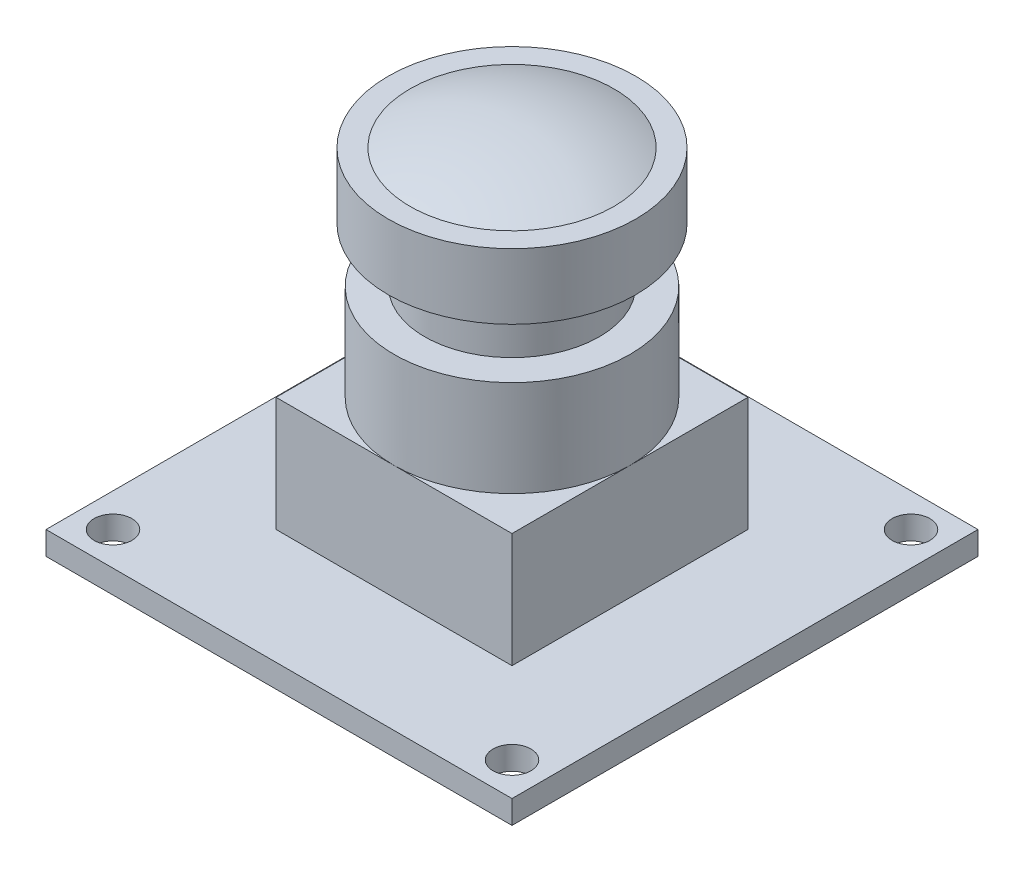
ISO-10303-21;
HEADER;
FILE_DESCRIPTION(('STEP AP214'),'2;1');
FILE_NAME('part.step','',(''),(''),'','','');
FILE_SCHEMA(('AUTOMOTIVE_DESIGN { 1 0 10303 214 1 1 1 1 }'));
ENDSEC;
DATA;
#1=APPLICATION_CONTEXT('core data for automotive mechanical design processes');
#2=APPLICATION_PROTOCOL_DEFINITION('international standard','automotive_design',2000,#1);
#3=PRODUCT_CONTEXT('',#1,'mechanical');
#4=PRODUCT('Part','Part','',(#3));
#5=PRODUCT_RELATED_PRODUCT_CATEGORY('part','',(#4));
#6=PRODUCT_DEFINITION_FORMATION('','',#4);
#7=PRODUCT_DEFINITION_CONTEXT('part definition',#1,'design');
#8=PRODUCT_DEFINITION('design','',#6,#7);
#9=PRODUCT_DEFINITION_SHAPE('','',#8);
#10=(LENGTH_UNIT() NAMED_UNIT(*) SI_UNIT(.MILLI.,.METRE.));
#11=(NAMED_UNIT(*) PLANE_ANGLE_UNIT() SI_UNIT($,.RADIAN.));
#12=(NAMED_UNIT(*) SI_UNIT($,.STERADIAN.) SOLID_ANGLE_UNIT());
#13=UNCERTAINTY_MEASURE_WITH_UNIT(LENGTH_MEASURE(1.E-05),#10,'distance_accuracy_value','');
#14=(GEOMETRIC_REPRESENTATION_CONTEXT(3) GLOBAL_UNCERTAINTY_ASSIGNED_CONTEXT((#13)) GLOBAL_UNIT_ASSIGNED_CONTEXT((#10,
#11,#12)) REPRESENTATION_CONTEXT('',''));
#15=CARTESIAN_POINT('',(0.,0.,0.));
#16=DIRECTION('',(0.,0.,1.));
#17=DIRECTION('',(1.,0.,0.));
#18=AXIS2_PLACEMENT_3D('',#15,#16,#17);
#19=CARTESIAN_POINT('',(0.,9.46,0.));
#20=DIRECTION('',(0.,-1.,0.));
#21=DIRECTION('',(0.,0.,-1.));
#22=AXIS2_PLACEMENT_3D('',#19,#20,#21);
#23=PLANE('',#22);
#24=DIRECTION('',(0.,0.,-1.));
#25=VECTOR('',#24,1.);
#26=CARTESIAN_POINT('',(8.1,9.46,8.1));
#27=LINE('',#26,#25);
#28=CARTESIAN_POINT('',(8.1,9.46,8.1));
#29=VERTEX_POINT('',#28);
#30=CARTESIAN_POINT('',(8.1,9.46,0.));
#31=VERTEX_POINT('',#30);
#32=EDGE_CURVE('E126',#29,#31,#27,.T.);
#33=ORIENTED_EDGE('',*,*,#32,.T.);
#34=CARTESIAN_POINT('',(0.,9.46,0.));
#35=DIRECTION('',(0.,-1.,0.));
#36=DIRECTION('',(1.,0.,0.));
#37=AXIS2_PLACEMENT_3D('',#34,#35,#36);
#38=CIRCLE('',#37,8.1);
#39=CARTESIAN_POINT('',(0.,9.46,8.1));
#40=VERTEX_POINT('',#39);
#41=EDGE_CURVE('E49',#31,#40,#38,.T.);
#42=ORIENTED_EDGE('',*,*,#41,.T.);
#43=DIRECTION('',(1.,0.,0.));
#44=VECTOR('',#43,1.);
#45=CARTESIAN_POINT('',(-8.1,9.46,8.1));
#46=LINE('',#45,#44);
#47=EDGE_CURVE('E123',#40,#29,#46,.T.);
#48=ORIENTED_EDGE('',*,*,#47,.T.);
#49=EDGE_LOOP('',(#33,#42,#48));
#50=FACE_BOUND('',#49,.T.);
#51=ADVANCED_FACE('F38',(#50),#23,.F.);
#52=CARTESIAN_POINT('',(-8.1,9.46,8.1));
#53=VERTEX_POINT('',#52);
#54=EDGE_CURVE('E133',#53,#40,#46,.T.);
#55=ORIENTED_EDGE('',*,*,#54,.T.);
#56=CARTESIAN_POINT('',(-8.1,9.46,0.));
#57=VERTEX_POINT('',#56);
#58=EDGE_CURVE('E11',#40,#57,#38,.T.);
#59=ORIENTED_EDGE('',*,*,#58,.T.);
#60=DIRECTION('',(0.,0.,1.));
#61=VECTOR('',#60,1.);
#62=CARTESIAN_POINT('',(-8.1,9.46,8.1));
#63=LINE('',#62,#61);
#64=EDGE_CURVE('E139',#57,#53,#63,.T.);
#65=ORIENTED_EDGE('',*,*,#64,.T.);
#66=EDGE_LOOP('',(#55,#59,#65));
#67=FACE_BOUND('',#66,.T.);
#68=ADVANCED_FACE('F138',(#67),#23,.F.);
#69=CARTESIAN_POINT('',(-8.1,9.46,-8.1));
#70=VERTEX_POINT('',#69);
#71=EDGE_CURVE('E136',#70,#57,#63,.T.);
#72=ORIENTED_EDGE('',*,*,#71,.T.);
#73=CARTESIAN_POINT('',(0.,9.46,-8.1));
#74=VERTEX_POINT('',#73);
#75=EDGE_CURVE('E47',#57,#74,#38,.T.);
#76=ORIENTED_EDGE('',*,*,#75,.T.);
#77=DIRECTION('',(-1.,0.,0.));
#78=VECTOR('',#77,1.);
#79=CARTESIAN_POINT('',(-8.1,9.46,-8.1));
#80=LINE('',#79,#78);
#81=EDGE_CURVE('E225',#74,#70,#80,.T.);
#82=ORIENTED_EDGE('',*,*,#81,.T.);
#83=EDGE_LOOP('',(#72,#76,#82));
#84=FACE_BOUND('',#83,.T.);
#85=ADVANCED_FACE('F232',(#84),#23,.F.);
#86=CARTESIAN_POINT('',(0.,1.6,0.));
#87=DIRECTION('',(0.,-1.,0.));
#88=DIRECTION('',(0.,0.,-1.));
#89=AXIS2_PLACEMENT_3D('',#86,#87,#88);
#90=PLANE('',#89);
#91=CARTESIAN_POINT('',(-13.7,1.6,13.7));
#92=DIRECTION('',(0.,1.,0.));
#93=DIRECTION('',(0.,0.,1.));
#94=AXIS2_PLACEMENT_3D('',#91,#92,#93);
#95=CIRCLE('',#94,1.3);
#96=CARTESIAN_POINT('',(-13.7,1.6,15.));
#97=VERTEX_POINT('',#96);
#98=EDGE_CURVE('E164',#97,#97,#95,.T.);
#99=ORIENTED_EDGE('',*,*,#98,.F.);
#100=EDGE_LOOP('',(#99));
#101=FACE_BOUND('',#100,.T.);
#102=CARTESIAN_POINT('',(13.7,1.6,13.7));
#103=DIRECTION('',(0.,1.,0.));
#104=DIRECTION('',(0.,0.,1.));
#105=AXIS2_PLACEMENT_3D('',#102,#103,#104);
#106=CIRCLE('',#105,1.3);
#107=CARTESIAN_POINT('',(13.7,1.6,15.));
#108=VERTEX_POINT('',#107);
#109=EDGE_CURVE('E170',#108,#108,#106,.T.);
#110=ORIENTED_EDGE('',*,*,#109,.F.);
#111=EDGE_LOOP('',(#110));
#112=FACE_BOUND('',#111,.T.);
#113=CARTESIAN_POINT('',(13.7,1.6,-13.7));
#114=DIRECTION('',(0.,1.,0.));
#115=DIRECTION('',(0.,0.,1.));
#116=AXIS2_PLACEMENT_3D('',#113,#114,#115);
#117=CIRCLE('',#116,1.3);
#118=CARTESIAN_POINT('',(13.7,1.6,-12.4));
#119=VERTEX_POINT('',#118);
#120=EDGE_CURVE('E176',#119,#119,#117,.T.);
#121=ORIENTED_EDGE('',*,*,#120,.F.);
#122=EDGE_LOOP('',(#121));
#123=FACE_BOUND('',#122,.T.);
#124=CARTESIAN_POINT('',(-13.7,1.6,-13.7));
#125=DIRECTION('',(0.,1.,0.));
#126=DIRECTION('',(0.,0.,1.));
#127=AXIS2_PLACEMENT_3D('',#124,#125,#126);
#128=CIRCLE('',#127,1.3);
#129=CARTESIAN_POINT('',(-13.7,1.6,-12.4));
#130=VERTEX_POINT('',#129);
#131=EDGE_CURVE('E182',#130,#130,#128,.T.);
#132=ORIENTED_EDGE('',*,*,#131,.F.);
#133=EDGE_LOOP('',(#132));
#134=FACE_BOUND('',#133,.T.);
#135=DIRECTION('',(0.,0.,-1.));
#136=VECTOR('',#135,1.);
#137=CARTESIAN_POINT('',(16.,1.6,16.));
#138=LINE('',#137,#136);
#139=CARTESIAN_POINT('',(16.,1.6,16.));
#140=VERTEX_POINT('',#139);
#141=CARTESIAN_POINT('',(16.,1.6,-16.));
#142=VERTEX_POINT('',#141);
#143=EDGE_CURVE('E188',#140,#142,#138,.T.);
#144=ORIENTED_EDGE('',*,*,#143,.T.);
#145=DIRECTION('',(-1.,0.,0.));
#146=VECTOR('',#145,1.);
#147=CARTESIAN_POINT('',(-16.,1.6,-16.));
#148=LINE('',#147,#146);
#149=CARTESIAN_POINT('',(-16.,1.6,-16.));
#150=VERTEX_POINT('',#149);
#151=EDGE_CURVE('E191',#142,#150,#148,.T.);
#152=ORIENTED_EDGE('',*,*,#151,.T.);
#153=DIRECTION('',(0.,0.,1.));
#154=VECTOR('',#153,1.);
#155=CARTESIAN_POINT('',(-16.,1.6,16.));
#156=LINE('',#155,#154);
#157=CARTESIAN_POINT('',(-16.,1.6,16.));
#158=VERTEX_POINT('',#157);
#159=EDGE_CURVE('E194',#150,#158,#156,.T.);
#160=ORIENTED_EDGE('',*,*,#159,.T.);
#161=DIRECTION('',(1.,0.,0.));
#162=VECTOR('',#161,1.);
#163=CARTESIAN_POINT('',(-16.,1.6,16.));
#164=LINE('',#163,#162);
#165=EDGE_CURVE('E196',#158,#140,#164,.T.);
#166=ORIENTED_EDGE('',*,*,#165,.T.);
#167=EDGE_LOOP('',(#144,#152,#160,#166));
#168=FACE_BOUND('',#167,.T.);
#169=DIRECTION('',(0.,0.,-1.));
#170=VECTOR('',#169,1.);
#171=CARTESIAN_POINT('',(8.1,1.6,8.1));
#172=LINE('',#171,#170);
#173=CARTESIAN_POINT('',(8.1,1.6,8.1));
#174=VERTEX_POINT('',#173);
#175=CARTESIAN_POINT('',(8.1,1.6,-8.1));
#176=VERTEX_POINT('',#175);
#177=EDGE_CURVE('E63',#174,#176,#172,.T.);
#178=ORIENTED_EDGE('',*,*,#177,.F.);
#179=DIRECTION('',(1.,0.,0.));
#180=VECTOR('',#179,1.);
#181=CARTESIAN_POINT('',(-8.1,1.6,8.1));
#182=LINE('',#181,#180);
#183=CARTESIAN_POINT('',(-8.1,1.6,8.1));
#184=VERTEX_POINT('',#183);
#185=EDGE_CURVE('E153',#184,#174,#182,.T.);
#186=ORIENTED_EDGE('',*,*,#185,.F.);
#187=DIRECTION('',(0.,0.,1.));
#188=VECTOR('',#187,1.);
#189=CARTESIAN_POINT('',(-8.1,1.6,8.1));
#190=LINE('',#189,#188);
#191=CARTESIAN_POINT('',(-8.1,1.6,-8.1));
#192=VERTEX_POINT('',#191);
#193=EDGE_CURVE('E150',#192,#184,#190,.T.);
#194=ORIENTED_EDGE('',*,*,#193,.F.);
#195=DIRECTION('',(-1.,0.,0.));
#196=VECTOR('',#195,1.);
#197=CARTESIAN_POINT('',(-8.1,1.6,-8.1));
#198=LINE('',#197,#196);
#199=EDGE_CURVE('E147',#176,#192,#198,.T.);
#200=ORIENTED_EDGE('',*,*,#199,.F.);
#201=EDGE_LOOP('',(#178,#186,#194,#200));
#202=FACE_BOUND('',#201,.T.);
#203=ADVANCED_FACE('F253',(#101,#112,#123,#134,#168,#202),#90,.F.);
#204=CARTESIAN_POINT('',(0.,0.,0.));
#205=DIRECTION('',(0.,-1.,0.));
#206=DIRECTION('',(0.,0.,-1.));
#207=AXIS2_PLACEMENT_3D('',#204,#205,#206);
#208=PLANE('',#207);
#209=CARTESIAN_POINT('',(13.7,0.,13.7));
#210=DIRECTION('',(0.,1.,0.));
#211=DIRECTION('',(0.,0.,1.));
#212=AXIS2_PLACEMENT_3D('',#209,#210,#211);
#213=CIRCLE('',#212,1.3);
#214=CARTESIAN_POINT('',(13.7,0.,15.));
#215=VERTEX_POINT('',#214);
#216=EDGE_CURVE('E167',#215,#215,#213,.T.);
#217=ORIENTED_EDGE('',*,*,#216,.T.);
#218=EDGE_LOOP('',(#217));
#219=FACE_BOUND('',#218,.T.);
#220=CARTESIAN_POINT('',(-13.7,0.,-13.7));
#221=DIRECTION('',(0.,1.,0.));
#222=DIRECTION('',(0.,0.,1.));
#223=AXIS2_PLACEMENT_3D('',#220,#221,#222);
#224=CIRCLE('',#223,1.3);
#225=CARTESIAN_POINT('',(-13.7,0.,-12.4));
#226=VERTEX_POINT('',#225);
#227=EDGE_CURVE('E179',#226,#226,#224,.T.);
#228=ORIENTED_EDGE('',*,*,#227,.T.);
#229=EDGE_LOOP('',(#228));
#230=FACE_BOUND('',#229,.T.);
#231=DIRECTION('',(0.,0.,-1.));
#232=VECTOR('',#231,1.);
#233=CARTESIAN_POINT('',(16.,0.,16.));
#234=LINE('',#233,#232);
#235=CARTESIAN_POINT('',(16.,0.,16.));
#236=VERTEX_POINT('',#235);
#237=CARTESIAN_POINT('',(16.,0.,-16.));
#238=VERTEX_POINT('',#237);
#239=EDGE_CURVE('E185',#236,#238,#234,.T.);
#240=ORIENTED_EDGE('',*,*,#239,.F.);
#241=DIRECTION('',(1.,0.,0.));
#242=VECTOR('',#241,1.);
#243=CARTESIAN_POINT('',(-16.,0.,16.));
#244=LINE('',#243,#242);
#245=CARTESIAN_POINT('',(-16.,0.,16.));
#246=VERTEX_POINT('',#245);
#247=EDGE_CURVE('E192',#246,#236,#244,.T.);
#248=ORIENTED_EDGE('',*,*,#247,.F.);
#249=DIRECTION('',(0.,0.,1.));
#250=VECTOR('',#249,1.);
#251=CARTESIAN_POINT('',(-16.,0.,16.));
#252=LINE('',#251,#250);
#253=CARTESIAN_POINT('',(-16.,0.,-16.));
#254=VERTEX_POINT('',#253);
#255=EDGE_CURVE('E203',#254,#246,#252,.T.);
#256=ORIENTED_EDGE('',*,*,#255,.F.);
#257=DIRECTION('',(-1.,0.,0.));
#258=VECTOR('',#257,1.);
#259=CARTESIAN_POINT('',(-16.,0.,-16.));
#260=LINE('',#259,#258);
#261=EDGE_CURVE('E201',#238,#254,#260,.T.);
#262=ORIENTED_EDGE('',*,*,#261,.F.);
#263=EDGE_LOOP('',(#240,#248,#256,#262));
#264=FACE_BOUND('',#263,.T.);
#265=CARTESIAN_POINT('',(13.7,0.,-13.7));
#266=DIRECTION('',(0.,1.,0.));
#267=DIRECTION('',(0.,0.,1.));
#268=AXIS2_PLACEMENT_3D('',#265,#266,#267);
#269=CIRCLE('',#268,1.3);
#270=CARTESIAN_POINT('',(13.7,0.,-12.4));
#271=VERTEX_POINT('',#270);
#272=EDGE_CURVE('E173',#271,#271,#269,.T.);
#273=ORIENTED_EDGE('',*,*,#272,.T.);
#274=EDGE_LOOP('',(#273));
#275=FACE_BOUND('',#274,.T.);
#276=CARTESIAN_POINT('',(-13.7,0.,13.7));
#277=DIRECTION('',(0.,1.,0.));
#278=DIRECTION('',(0.,0.,1.));
#279=AXIS2_PLACEMENT_3D('',#276,#277,#278);
#280=CIRCLE('',#279,1.3);
#281=CARTESIAN_POINT('',(-13.7,0.,15.));
#282=VERTEX_POINT('',#281);
#283=EDGE_CURVE('E163',#282,#282,#280,.T.);
#284=ORIENTED_EDGE('',*,*,#283,.T.);
#285=EDGE_LOOP('',(#284));
#286=FACE_BOUND('',#285,.T.);
#287=ADVANCED_FACE('F258',(#219,#230,#264,#275,#286),#208,.T.);
#288=CARTESIAN_POINT('',(16.,1.6,16.));
#289=DIRECTION('',(-1.,0.,0.));
#290=DIRECTION('',(0.,0.,1.));
#291=AXIS2_PLACEMENT_3D('',#288,#289,#290);
#292=PLANE('',#291);
#293=ORIENTED_EDGE('',*,*,#239,.T.);
#294=DIRECTION('',(0.,-1.,0.));
#295=VECTOR('',#294,1.);
#296=CARTESIAN_POINT('',(16.,1.6,-16.));
#297=LINE('',#296,#295);
#298=EDGE_CURVE('E42',#142,#238,#297,.T.);
#299=ORIENTED_EDGE('',*,*,#298,.F.);
#300=ORIENTED_EDGE('',*,*,#143,.F.);
#301=DIRECTION('',(0.,-1.,0.));
#302=VECTOR('',#301,1.);
#303=CARTESIAN_POINT('',(16.,1.6,16.));
#304=LINE('',#303,#302);
#305=EDGE_CURVE('E198',#140,#236,#304,.T.);
#306=ORIENTED_EDGE('',*,*,#305,.T.);
#307=EDGE_LOOP('',(#293,#299,#300,#306));
#308=FACE_BOUND('',#307,.T.);
#309=ADVANCED_FACE('F40',(#308),#292,.F.);
#310=CARTESIAN_POINT('',(-16.,1.6,-16.));
#311=DIRECTION('',(0.,0.,1.));
#312=DIRECTION('',(1.,0.,0.));
#313=AXIS2_PLACEMENT_3D('',#310,#311,#312);
#314=PLANE('',#313);
#315=ORIENTED_EDGE('',*,*,#261,.T.);
#316=DIRECTION('',(0.,-1.,0.));
#317=VECTOR('',#316,1.);
#318=CARTESIAN_POINT('',(-16.,1.6,-16.));
#319=LINE('',#318,#317);
#320=EDGE_CURVE('E210',#150,#254,#319,.T.);
#321=ORIENTED_EDGE('',*,*,#320,.F.);
#322=ORIENTED_EDGE('',*,*,#151,.F.);
#323=ORIENTED_EDGE('',*,*,#298,.T.);
#324=EDGE_LOOP('',(#315,#321,#322,#323));
#325=FACE_BOUND('',#324,.T.);
#326=ADVANCED_FACE('F337',(#325),#314,.F.);
#327=CARTESIAN_POINT('',(-16.,1.6,16.));
#328=DIRECTION('',(1.,0.,0.));
#329=DIRECTION('',(0.,0.,-1.));
#330=AXIS2_PLACEMENT_3D('',#327,#328,#329);
#331=PLANE('',#330);
#332=ORIENTED_EDGE('',*,*,#255,.T.);
#333=DIRECTION('',(0.,-1.,0.));
#334=VECTOR('',#333,1.);
#335=CARTESIAN_POINT('',(-16.,1.6,16.));
#336=LINE('',#335,#334);
#337=EDGE_CURVE('E208',#158,#246,#336,.T.);
#338=ORIENTED_EDGE('',*,*,#337,.F.);
#339=ORIENTED_EDGE('',*,*,#159,.F.);
#340=ORIENTED_EDGE('',*,*,#320,.T.);
#341=EDGE_LOOP('',(#332,#338,#339,#340));
#342=FACE_BOUND('',#341,.T.);
#343=ADVANCED_FACE('F327',(#342),#331,.F.);
#344=CARTESIAN_POINT('',(-16.,1.6,16.));
#345=DIRECTION('',(0.,0.,-1.));
#346=DIRECTION('',(-1.,0.,0.));
#347=AXIS2_PLACEMENT_3D('',#344,#345,#346);
#348=PLANE('',#347);
#349=ORIENTED_EDGE('',*,*,#247,.T.);
#350=ORIENTED_EDGE('',*,*,#305,.F.);
#351=ORIENTED_EDGE('',*,*,#165,.F.);
#352=ORIENTED_EDGE('',*,*,#337,.T.);
#353=EDGE_LOOP('',(#349,#350,#351,#352));
#354=FACE_BOUND('',#353,.T.);
#355=ADVANCED_FACE('F317',(#354),#348,.F.);
#356=CARTESIAN_POINT('',(-13.7,1.6,-13.7));
#357=DIRECTION('',(0.,-1.,0.));
#358=DIRECTION('',(0.,0.,-1.));
#359=AXIS2_PLACEMENT_3D('',#356,#357,#358);
#360=CYLINDRICAL_SURFACE('',#359,1.3);
#361=ORIENTED_EDGE('',*,*,#131,.T.);
#362=EDGE_LOOP('',(#361));
#363=FACE_BOUND('',#362,.T.);
#364=ORIENTED_EDGE('',*,*,#227,.F.);
#365=EDGE_LOOP('',(#364));
#366=FACE_BOUND('',#365,.T.);
#367=ADVANCED_FACE('F307',(#363,#366),#360,.F.);
#368=CARTESIAN_POINT('',(13.7,1.6,-13.7));
#369=DIRECTION('',(0.,-1.,0.));
#370=DIRECTION('',(0.,0.,-1.));
#371=AXIS2_PLACEMENT_3D('',#368,#369,#370);
#372=CYLINDRICAL_SURFACE('',#371,1.3);
#373=ORIENTED_EDGE('',*,*,#120,.T.);
#374=EDGE_LOOP('',(#373));
#375=FACE_BOUND('',#374,.T.);
#376=ORIENTED_EDGE('',*,*,#272,.F.);
#377=EDGE_LOOP('',(#376));
#378=FACE_BOUND('',#377,.T.);
#379=ADVANCED_FACE('F297',(#375,#378),#372,.F.);
#380=CARTESIAN_POINT('',(13.7,1.6,13.7));
#381=DIRECTION('',(0.,-1.,0.));
#382=DIRECTION('',(0.,0.,-1.));
#383=AXIS2_PLACEMENT_3D('',#380,#381,#382);
#384=CYLINDRICAL_SURFACE('',#383,1.3);
#385=ORIENTED_EDGE('',*,*,#109,.T.);
#386=EDGE_LOOP('',(#385));
#387=FACE_BOUND('',#386,.T.);
#388=ORIENTED_EDGE('',*,*,#216,.F.);
#389=EDGE_LOOP('',(#388));
#390=FACE_BOUND('',#389,.T.);
#391=ADVANCED_FACE('F286',(#387,#390),#384,.F.);
#392=CARTESIAN_POINT('',(-13.7,1.6,13.7));
#393=DIRECTION('',(0.,-1.,0.));
#394=DIRECTION('',(0.,0.,-1.));
#395=AXIS2_PLACEMENT_3D('',#392,#393,#394);
#396=CYLINDRICAL_SURFACE('',#395,1.3);
#397=ORIENTED_EDGE('',*,*,#98,.T.);
#398=EDGE_LOOP('',(#397));
#399=FACE_BOUND('',#398,.T.);
#400=ORIENTED_EDGE('',*,*,#283,.F.);
#401=EDGE_LOOP('',(#400));
#402=FACE_BOUND('',#401,.T.);
#403=ADVANCED_FACE('F282',(#399,#402),#396,.F.);
#404=CARTESIAN_POINT('',(8.1,9.46,8.1));
#405=DIRECTION('',(-1.,0.,0.));
#406=DIRECTION('',(0.,0.,1.));
#407=AXIS2_PLACEMENT_3D('',#404,#405,#406);
#408=PLANE('',#407);
#409=ORIENTED_EDGE('',*,*,#177,.T.);
#410=DIRECTION('',(0.,-1.,0.));
#411=VECTOR('',#410,1.);
#412=CARTESIAN_POINT('',(8.1,9.46,-8.1));
#413=LINE('',#412,#411);
#414=CARTESIAN_POINT('',(8.1,9.46,-8.1));
#415=VERTEX_POINT('',#414);
#416=EDGE_CURVE('E160',#415,#176,#413,.T.);
#417=ORIENTED_EDGE('',*,*,#416,.F.);
#418=EDGE_CURVE('E154',#31,#415,#27,.T.);
#419=ORIENTED_EDGE('',*,*,#418,.F.);
#420=ORIENTED_EDGE('',*,*,#32,.F.);
#421=DIRECTION('',(0.,-1.,0.));
#422=VECTOR('',#421,1.);
#423=CARTESIAN_POINT('',(8.1,9.46,8.1));
#424=LINE('',#423,#422);
#425=EDGE_CURVE('E135',#29,#174,#424,.T.);
#426=ORIENTED_EDGE('',*,*,#425,.T.);
#427=EDGE_LOOP('',(#409,#417,#419,#420,#426));
#428=FACE_BOUND('',#427,.T.);
#429=ADVANCED_FACE('F239',(#428),#408,.F.);
#430=CARTESIAN_POINT('',(-8.1,9.46,-8.1));
#431=DIRECTION('',(0.,0.,1.));
#432=DIRECTION('',(1.,0.,0.));
#433=AXIS2_PLACEMENT_3D('',#430,#431,#432);
#434=PLANE('',#433);
#435=ORIENTED_EDGE('',*,*,#199,.T.);
#436=DIRECTION('',(0.,-1.,0.));
#437=VECTOR('',#436,1.);
#438=CARTESIAN_POINT('',(-8.1,9.46,-8.1));
#439=LINE('',#438,#437);
#440=EDGE_CURVE('E157',#70,#192,#439,.T.);
#441=ORIENTED_EDGE('',*,*,#440,.F.);
#442=ORIENTED_EDGE('',*,*,#81,.F.);
#443=EDGE_CURVE('E226',#415,#74,#80,.T.);
#444=ORIENTED_EDGE('',*,*,#443,.F.);
#445=ORIENTED_EDGE('',*,*,#416,.T.);
#446=EDGE_LOOP('',(#435,#441,#442,#444,#445));
#447=FACE_BOUND('',#446,.T.);
#448=ADVANCED_FACE('F235',(#447),#434,.F.);
#449=CARTESIAN_POINT('',(-8.1,9.46,8.1));
#450=DIRECTION('',(1.,0.,0.));
#451=DIRECTION('',(0.,0.,-1.));
#452=AXIS2_PLACEMENT_3D('',#449,#450,#451);
#453=PLANE('',#452);
#454=ORIENTED_EDGE('',*,*,#193,.T.);
#455=DIRECTION('',(0.,-1.,0.));
#456=VECTOR('',#455,1.);
#457=CARTESIAN_POINT('',(-8.1,9.46,8.1));
#458=LINE('',#457,#456);
#459=EDGE_CURVE('E141',#53,#184,#458,.T.);
#460=ORIENTED_EDGE('',*,*,#459,.F.);
#461=ORIENTED_EDGE('',*,*,#64,.F.);
#462=ORIENTED_EDGE('',*,*,#71,.F.);
#463=ORIENTED_EDGE('',*,*,#440,.T.);
#464=EDGE_LOOP('',(#454,#460,#461,#462,#463));
#465=FACE_BOUND('',#464,.T.);
#466=ADVANCED_FACE('F237',(#465),#453,.F.);
#467=CARTESIAN_POINT('',(-8.1,9.46,8.1));
#468=DIRECTION('',(0.,0.,-1.));
#469=DIRECTION('',(-1.,0.,0.));
#470=AXIS2_PLACEMENT_3D('',#467,#468,#469);
#471=PLANE('',#470);
#472=ORIENTED_EDGE('',*,*,#185,.T.);
#473=ORIENTED_EDGE('',*,*,#425,.F.);
#474=ORIENTED_EDGE('',*,*,#47,.F.);
#475=ORIENTED_EDGE('',*,*,#54,.F.);
#476=ORIENTED_EDGE('',*,*,#459,.T.);
#477=EDGE_LOOP('',(#472,#473,#474,#475,#476));
#478=FACE_BOUND('',#477,.T.);
#479=ADVANCED_FACE('F131',(#478),#471,.F.);
#480=ORIENTED_EDGE('',*,*,#443,.T.);
#481=EDGE_CURVE('E128',#74,#31,#38,.T.);
#482=ORIENTED_EDGE('',*,*,#481,.T.);
#483=ORIENTED_EDGE('',*,*,#418,.T.);
#484=EDGE_LOOP('',(#480,#482,#483));
#485=FACE_BOUND('',#484,.T.);
#486=ADVANCED_FACE('F241',(#485),#23,.F.);
#487=CARTESIAN_POINT('',(0.,9.46,0.));
#488=DIRECTION('',(0.,-1.,0.));
#489=DIRECTION('',(1.,0.,0.));
#490=AXIS2_PLACEMENT_3D('',#487,#488,#489);
#491=CYLINDRICAL_SURFACE('',#490,8.1);
#492=ORIENTED_EDGE('',*,*,#41,.F.);
#493=ORIENTED_EDGE('',*,*,#481,.F.);
#494=ORIENTED_EDGE('',*,*,#75,.F.);
#495=ORIENTED_EDGE('',*,*,#58,.F.);
#496=EDGE_LOOP('',(#492,#493,#494,#495));
#497=FACE_BOUND('',#496,.T.);
#498=CARTESIAN_POINT('',(0.,16.06,0.));
#499=DIRECTION('',(0.,-1.,0.));
#500=DIRECTION('',(1.,0.,0.));
#501=AXIS2_PLACEMENT_3D('',#498,#499,#500);
#502=CIRCLE('',#501,8.1);
#503=CARTESIAN_POINT('',(8.1,16.06,0.));
#504=VERTEX_POINT('',#503);
#505=EDGE_CURVE('E127',#504,#504,#502,.T.);
#506=ORIENTED_EDGE('',*,*,#505,.T.);
#507=EDGE_LOOP('',(#506));
#508=FACE_BOUND('',#507,.T.);
#509=ADVANCED_FACE('F114',(#497,#508),#491,.T.);
#510=CARTESIAN_POINT('',(0.,16.06,0.));
#511=DIRECTION('',(0.,-1.,0.));
#512=DIRECTION('',(1.,0.,0.));
#513=AXIS2_PLACEMENT_3D('',#510,#511,#512);
#514=PLANE('',#513);
#515=ORIENTED_EDGE('',*,*,#505,.F.);
#516=EDGE_LOOP('',(#515));
#517=FACE_BOUND('',#516,.T.);
#518=CARTESIAN_POINT('',(0.,16.06,0.));
#519=DIRECTION('',(0.,-1.,0.));
#520=DIRECTION('',(1.,0.,0.));
#521=AXIS2_PLACEMENT_3D('',#518,#519,#520);
#522=CIRCLE('',#521,6.);
#523=CARTESIAN_POINT('',(6.,16.06,0.));
#524=VERTEX_POINT('',#523);
#525=EDGE_CURVE('E479',#524,#524,#522,.T.);
#526=ORIENTED_EDGE('',*,*,#525,.T.);
#527=EDGE_LOOP('',(#526));
#528=FACE_BOUND('',#527,.T.);
#529=ADVANCED_FACE('F248',(#517,#528),#514,.F.);
#530=CARTESIAN_POINT('',(0.,9.46,0.));
#531=DIRECTION('',(0.,-1.,0.));
#532=DIRECTION('',(1.,0.,0.));
#533=AXIS2_PLACEMENT_3D('',#530,#531,#532);
#534=CYLINDRICAL_SURFACE('',#533,6.);
#535=ORIENTED_EDGE('',*,*,#525,.F.);
#536=EDGE_LOOP('',(#535));
#537=FACE_BOUND('',#536,.T.);
#538=CARTESIAN_POINT('',(0.,19.81,0.));
#539=DIRECTION('',(0.,-1.,0.));
#540=DIRECTION('',(1.,0.,0.));
#541=AXIS2_PLACEMENT_3D('',#538,#539,#540);
#542=CIRCLE('',#541,6.);
#543=CARTESIAN_POINT('',(6.,19.81,0.));
#544=VERTEX_POINT('',#543);
#545=EDGE_CURVE('E477',#544,#544,#542,.T.);
#546=ORIENTED_EDGE('',*,*,#545,.T.);
#547=EDGE_LOOP('',(#546));
#548=FACE_BOUND('',#547,.T.);
#549=ADVANCED_FACE('F399',(#537,#548),#534,.T.);
#550=CARTESIAN_POINT('',(0.,19.81,0.));
#551=DIRECTION('',(0.,1.,0.));
#552=DIRECTION('',(-1.,0.,0.));
#553=AXIS2_PLACEMENT_3D('',#550,#551,#552);
#554=PLANE('',#553);
#555=ORIENTED_EDGE('',*,*,#545,.F.);
#556=EDGE_LOOP('',(#555));
#557=FACE_BOUND('',#556,.T.);
#558=CARTESIAN_POINT('',(0.,19.81,0.));
#559=DIRECTION('',(0.,-1.,0.));
#560=DIRECTION('',(1.,0.,0.));
#561=AXIS2_PLACEMENT_3D('',#558,#559,#560);
#562=CIRCLE('',#561,8.5);
#563=CARTESIAN_POINT('',(8.5,19.81,0.));
#564=VERTEX_POINT('',#563);
#565=EDGE_CURVE('E472',#564,#564,#562,.T.);
#566=ORIENTED_EDGE('',*,*,#565,.T.);
#567=EDGE_LOOP('',(#566));
#568=FACE_BOUND('',#567,.T.);
#569=ADVANCED_FACE('F410',(#557,#568),#554,.F.);
#570=CARTESIAN_POINT('',(0.,9.46,0.));
#571=DIRECTION('',(0.,-1.,0.));
#572=DIRECTION('',(1.,0.,0.));
#573=AXIS2_PLACEMENT_3D('',#570,#571,#572);
#574=CYLINDRICAL_SURFACE('',#573,8.5);
#575=ORIENTED_EDGE('',*,*,#565,.F.);
#576=EDGE_LOOP('',(#575));
#577=FACE_BOUND('',#576,.T.);
#578=CARTESIAN_POINT('',(0.,24.31,0.));
#579=DIRECTION('',(0.,-1.,0.));
#580=DIRECTION('',(1.,0.,0.));
#581=AXIS2_PLACEMENT_3D('',#578,#579,#580);
#582=CIRCLE('',#581,8.5);
#583=CARTESIAN_POINT('',(8.5,24.31,0.));
#584=VERTEX_POINT('',#583);
#585=EDGE_CURVE('E469',#584,#584,#582,.T.);
#586=ORIENTED_EDGE('',*,*,#585,.T.);
#587=EDGE_LOOP('',(#586));
#588=FACE_BOUND('',#587,.T.);
#589=ADVANCED_FACE('F421',(#577,#588),#574,.T.);
#590=CARTESIAN_POINT('',(0.,24.31,0.));
#591=DIRECTION('',(0.,-1.,0.));
#592=DIRECTION('',(1.,0.,0.));
#593=AXIS2_PLACEMENT_3D('',#590,#591,#592);
#594=PLANE('',#593);
#595=ORIENTED_EDGE('',*,*,#585,.F.);
#596=EDGE_LOOP('',(#595));
#597=FACE_BOUND('',#596,.T.);
#598=CARTESIAN_POINT('',(0.,24.31,0.));
#599=DIRECTION('',(0.,-1.,0.));
#600=DIRECTION('',(1.,0.,0.));
#601=AXIS2_PLACEMENT_3D('',#598,#599,#600);
#602=CIRCLE('',#601,7.00000000000001);
#603=CARTESIAN_POINT('',(7.00000000000001,24.31,0.));
#604=VERTEX_POINT('',#603);
#605=EDGE_CURVE('E467',#604,#604,#602,.T.);
#606=ORIENTED_EDGE('',*,*,#605,.T.);
#607=EDGE_LOOP('',(#606));
#608=FACE_BOUND('',#607,.T.);
#609=ADVANCED_FACE('F433',(#597,#608),#594,.F.);
#610=CARTESIAN_POINT('',(0.,8.72666666666666,0.));
#611=DIRECTION('',(0.,-1.,0.));
#612=DIRECTION('',(1.,0.,0.));
#613=AXIS2_PLACEMENT_3D('',#610,#611,#612);
#614=SPHERICAL_SURFACE('',#613,17.0833333333334);
#615=ORIENTED_EDGE('',*,*,#605,.F.);
#616=EDGE_LOOP('',(#615));
#617=FACE_BOUND('',#616,.T.);
#618=ADVANCED_FACE('F444',(#617),#614,.T.);
#619=CLOSED_SHELL('',(#51,#68,#85,#203,#287,#309,#326,#343,#355,#367,#379,#391,#403,#429,#448,
#466,#479,#486,#509,#529,#549,#569,#589,#609,#618));
#620=MANIFOLD_SOLID_BREP('B2',#619);
#621=ADVANCED_BREP_SHAPE_REPRESENTATION('',(#18,#620),#14);
#622=SHAPE_DEFINITION_REPRESENTATION(#9,#621);
ENDSEC;
END-ISO-10303-21;
